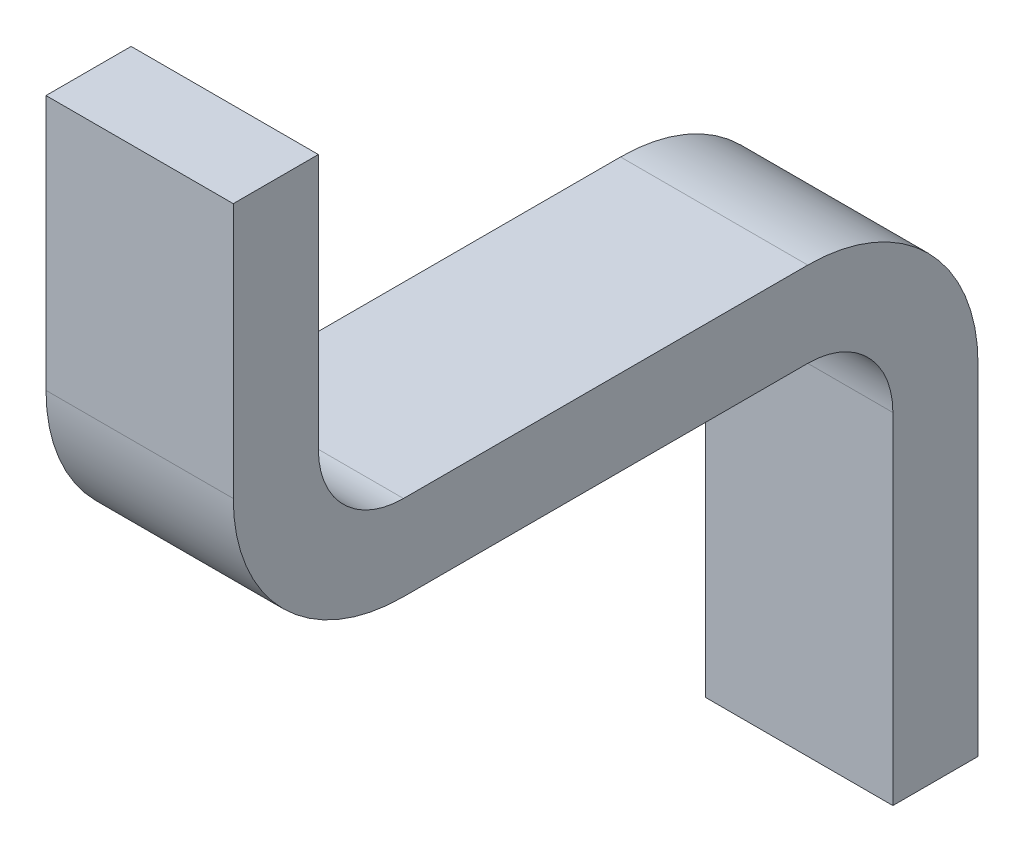
ISO-10303-21;
HEADER;
FILE_DESCRIPTION(('STEP AP214'),'2;1');
FILE_NAME('part.step','',(''),(''),'','','');
FILE_SCHEMA(('AUTOMOTIVE_DESIGN { 1 0 10303 214 1 1 1 1 }'));
ENDSEC;
DATA;
#1=APPLICATION_CONTEXT('core data for automotive mechanical design processes');
#2=APPLICATION_PROTOCOL_DEFINITION('international standard','automotive_design',2000,#1);
#3=PRODUCT_CONTEXT('',#1,'mechanical');
#4=PRODUCT('Part','Part','',(#3));
#5=PRODUCT_RELATED_PRODUCT_CATEGORY('part','',(#4));
#6=PRODUCT_DEFINITION_FORMATION('','',#4);
#7=PRODUCT_DEFINITION_CONTEXT('part definition',#1,'design');
#8=PRODUCT_DEFINITION('design','',#6,#7);
#9=PRODUCT_DEFINITION_SHAPE('','',#8);
#10=(LENGTH_UNIT() NAMED_UNIT(*) SI_UNIT(.MILLI.,.METRE.));
#11=(NAMED_UNIT(*) PLANE_ANGLE_UNIT() SI_UNIT($,.RADIAN.));
#12=(NAMED_UNIT(*) SI_UNIT($,.STERADIAN.) SOLID_ANGLE_UNIT());
#13=UNCERTAINTY_MEASURE_WITH_UNIT(LENGTH_MEASURE(1.E-05),#10,'distance_accuracy_value','');
#14=(GEOMETRIC_REPRESENTATION_CONTEXT(3) GLOBAL_UNCERTAINTY_ASSIGNED_CONTEXT((#13)) GLOBAL_UNIT_ASSIGNED_CONTEXT((#10,
#11,#12)) REPRESENTATION_CONTEXT('',''));
#15=CARTESIAN_POINT('',(0.,0.,0.));
#16=DIRECTION('',(0.,0.,1.));
#17=DIRECTION('',(1.,0.,0.));
#18=AXIS2_PLACEMENT_3D('',#15,#16,#17);
#19=CARTESIAN_POINT('',(0.64,-4.,0.675));
#20=DIRECTION('',(1.,0.,0.));
#21=DIRECTION('',(0.,1.,0.));
#22=AXIS2_PLACEMENT_3D('',#19,#20,#21);
#23=PLANE('',#22);
#24=CARTESIAN_POINT('',(0.640000000000001,-3.8,0.675));
#25=DIRECTION('',(-1.,0.,0.));
#26=DIRECTION('',(0.,-1.,0.));
#27=AXIS2_PLACEMENT_3D('',#24,#25,#26);
#28=CIRCLE('',#27,0.2);
#29=CARTESIAN_POINT('',(0.640000000000001,-3.8,0.875));
#30=VERTEX_POINT('',#29);
#31=CARTESIAN_POINT('',(0.64,-4.,0.675));
#32=VERTEX_POINT('',#31);
#33=EDGE_CURVE('E150',#30,#32,#28,.F.);
#34=ORIENTED_EDGE('',*,*,#33,.F.);
#35=DIRECTION('',(0.,1.,0.));
#36=VECTOR('',#35,1.);
#37=CARTESIAN_POINT('',(0.64,-3.50000000000001,0.875));
#38=LINE('',#37,#36);
#39=CARTESIAN_POINT('',(0.64,-3.50000000000001,0.875));
#40=VERTEX_POINT('',#39);
#41=EDGE_CURVE('E147',#30,#40,#38,.T.);
#42=ORIENTED_EDGE('',*,*,#41,.T.);
#43=DIRECTION('',(0.,0.,1.));
#44=VECTOR('',#43,1.);
#45=CARTESIAN_POINT('',(0.64,-3.50000000000001,0.775));
#46=LINE('',#45,#44);
#47=CARTESIAN_POINT('',(0.64,-3.50000000000001,0.775));
#48=VERTEX_POINT('',#47);
#49=EDGE_CURVE('E141',#48,#40,#46,.T.);
#50=ORIENTED_EDGE('',*,*,#49,.F.);
#51=DIRECTION('',(0.,1.,0.));
#52=VECTOR('',#51,1.);
#53=CARTESIAN_POINT('',(0.64,-3.50000000000001,0.775));
#54=LINE('',#53,#52);
#55=CARTESIAN_POINT('',(0.640000000000001,-3.8,0.775));
#56=VERTEX_POINT('',#55);
#57=EDGE_CURVE('E115',#48,#56,#54,.F.);
#58=ORIENTED_EDGE('',*,*,#57,.T.);
#59=CARTESIAN_POINT('',(0.640000000000001,-3.8,0.675));
#60=DIRECTION('',(-1.,0.,0.));
#61=DIRECTION('',(0.,-1.,0.));
#62=AXIS2_PLACEMENT_3D('',#59,#60,#61);
#63=CIRCLE('',#62,0.1);
#64=CARTESIAN_POINT('',(0.640000000000001,-3.90000000000001,0.675));
#65=VERTEX_POINT('',#64);
#66=EDGE_CURVE('E215',#56,#65,#63,.F.);
#67=ORIENTED_EDGE('',*,*,#66,.T.);
#68=DIRECTION('',(0.,0.,1.));
#69=VECTOR('',#68,1.);
#70=CARTESIAN_POINT('',(0.640000000000001,-3.90000000000001,0.675));
#71=LINE('',#70,#69);
#72=CARTESIAN_POINT('',(0.640000000000001,-3.90000000000001,0.2));
#73=VERTEX_POINT('',#72);
#74=EDGE_CURVE('E181',#65,#73,#71,.F.);
#75=ORIENTED_EDGE('',*,*,#74,.T.);
#76=CARTESIAN_POINT('',(0.64,-4.1,0.2));
#77=DIRECTION('',(1.,0.,0.));
#78=DIRECTION('',(0.,1.,0.));
#79=AXIS2_PLACEMENT_3D('',#76,#77,#78);
#80=CIRCLE('',#79,0.2);
#81=CARTESIAN_POINT('',(0.64,-4.1,0.));
#82=VERTEX_POINT('',#81);
#83=EDGE_CURVE('E20',#82,#73,#80,.T.);
#84=ORIENTED_EDGE('',*,*,#83,.F.);
#85=DIRECTION('',(0.,1.,0.));
#86=VECTOR('',#85,1.);
#87=CARTESIAN_POINT('',(0.64,-4.1,0.));
#88=LINE('',#87,#86);
#89=CARTESIAN_POINT('',(0.64,-4.5,0.));
#90=VERTEX_POINT('',#89);
#91=EDGE_CURVE('E91',#82,#90,#88,.F.);
#92=ORIENTED_EDGE('',*,*,#91,.T.);
#93=DIRECTION('',(0.,0.,1.));
#94=VECTOR('',#93,1.);
#95=CARTESIAN_POINT('',(0.64,-4.5,0.));
#96=LINE('',#95,#94);
#97=CARTESIAN_POINT('',(0.64,-4.5,0.1));
#98=VERTEX_POINT('',#97);
#99=EDGE_CURVE('E163',#90,#98,#96,.T.);
#100=ORIENTED_EDGE('',*,*,#99,.T.);
#101=DIRECTION('',(0.,1.,0.));
#102=VECTOR('',#101,1.);
#103=CARTESIAN_POINT('',(0.64,-4.1,0.1));
#104=LINE('',#103,#102);
#105=CARTESIAN_POINT('',(0.64,-4.1,0.1));
#106=VERTEX_POINT('',#105);
#107=EDGE_CURVE('E159',#98,#106,#104,.T.);
#108=ORIENTED_EDGE('',*,*,#107,.T.);
#109=CARTESIAN_POINT('',(0.64,-4.1,0.2));
#110=DIRECTION('',(1.,0.,0.));
#111=DIRECTION('',(0.,1.,0.));
#112=AXIS2_PLACEMENT_3D('',#109,#110,#111);
#113=CIRCLE('',#112,0.1);
#114=CARTESIAN_POINT('',(0.64,-4.,0.2));
#115=VERTEX_POINT('',#114);
#116=EDGE_CURVE('E155',#106,#115,#113,.T.);
#117=ORIENTED_EDGE('',*,*,#116,.T.);
#118=DIRECTION('',(0.,0.,1.));
#119=VECTOR('',#118,1.);
#120=CARTESIAN_POINT('',(0.64,-4.,0.675));
#121=LINE('',#120,#119);
#122=EDGE_CURVE('E154',#115,#32,#121,.T.);
#123=ORIENTED_EDGE('',*,*,#122,.T.);
#124=EDGE_LOOP('',(#34,#42,#50,#58,#67,#75,#84,#92,#100,#108,#117,#123));
#125=FACE_BOUND('',#124,.T.);
#126=ADVANCED_FACE('F17',(#125),#23,.F.);
#127=CARTESIAN_POINT('',(0.64,-4.1,0.2));
#128=DIRECTION('',(1.,0.,0.));
#129=DIRECTION('',(0.,1.,0.));
#130=AXIS2_PLACEMENT_3D('',#127,#128,#129);
#131=CYLINDRICAL_SURFACE('',#130,0.2);
#132=CARTESIAN_POINT('',(0.86,-4.1,0.2));
#133=DIRECTION('',(1.,0.,0.));
#134=DIRECTION('',(0.,1.,0.));
#135=AXIS2_PLACEMENT_3D('',#132,#133,#134);
#136=CIRCLE('',#135,0.2);
#137=CARTESIAN_POINT('',(0.860000000000001,-3.90000000000001,0.2));
#138=VERTEX_POINT('',#137);
#139=CARTESIAN_POINT('',(0.86,-4.1,0.));
#140=VERTEX_POINT('',#139);
#141=EDGE_CURVE('E183',#138,#140,#136,.F.);
#142=ORIENTED_EDGE('',*,*,#141,.T.);
#143=DIRECTION('',(1.,0.,0.));
#144=VECTOR('',#143,1.);
#145=CARTESIAN_POINT('',(0.64,-4.1,0.));
#146=LINE('',#145,#144);
#147=EDGE_CURVE('E178',#140,#82,#146,.F.);
#148=ORIENTED_EDGE('',*,*,#147,.T.);
#149=ORIENTED_EDGE('',*,*,#83,.T.);
#150=DIRECTION('',(1.,0.,0.));
#151=VECTOR('',#150,1.);
#152=CARTESIAN_POINT('',(0.640000000000001,-3.90000000000001,0.2));
#153=LINE('',#152,#151);
#154=EDGE_CURVE('E217',#73,#138,#153,.T.);
#155=ORIENTED_EDGE('',*,*,#154,.T.);
#156=EDGE_LOOP('',(#142,#148,#149,#155));
#157=FACE_BOUND('',#156,.T.);
#158=ADVANCED_FACE('F254',(#157),#131,.T.);
#159=CARTESIAN_POINT('',(0.64,-4.1,0.));
#160=DIRECTION('',(0.,0.,1.));
#161=DIRECTION('',(1.,0.,0.));
#162=AXIS2_PLACEMENT_3D('',#159,#160,#161);
#163=PLANE('',#162);
#164=ORIENTED_EDGE('',*,*,#147,.F.);
#165=DIRECTION('',(0.,-1.,0.));
#166=VECTOR('',#165,1.);
#167=CARTESIAN_POINT('',(0.860000000000001,-3.90000000000001,0.));
#168=LINE('',#167,#166);
#169=CARTESIAN_POINT('',(0.86,-4.5,0.));
#170=VERTEX_POINT('',#169);
#171=EDGE_CURVE('E170',#140,#170,#168,.T.);
#172=ORIENTED_EDGE('',*,*,#171,.T.);
#173=DIRECTION('',(-1.,0.,0.));
#174=VECTOR('',#173,1.);
#175=CARTESIAN_POINT('',(0.64,-4.5,0.));
#176=LINE('',#175,#174);
#177=EDGE_CURVE('E173',#170,#90,#176,.T.);
#178=ORIENTED_EDGE('',*,*,#177,.T.);
#179=ORIENTED_EDGE('',*,*,#91,.F.);
#180=EDGE_LOOP('',(#164,#172,#178,#179));
#181=FACE_BOUND('',#180,.T.);
#182=ADVANCED_FACE('F257',(#181),#163,.F.);
#183=CARTESIAN_POINT('',(0.64,-4.5,0.));
#184=DIRECTION('',(0.,1.,0.));
#185=DIRECTION('',(-1.,0.,0.));
#186=AXIS2_PLACEMENT_3D('',#183,#184,#185);
#187=PLANE('',#186);
#188=DIRECTION('',(-1.,0.,0.));
#189=VECTOR('',#188,1.);
#190=CARTESIAN_POINT('',(0.86,-4.5,0.1));
#191=LINE('',#190,#189);
#192=CARTESIAN_POINT('',(0.86,-4.5,0.1));
#193=VERTEX_POINT('',#192);
#194=EDGE_CURVE('E160',#193,#98,#191,.T.);
#195=ORIENTED_EDGE('',*,*,#194,.T.);
#196=ORIENTED_EDGE('',*,*,#99,.F.);
#197=ORIENTED_EDGE('',*,*,#177,.F.);
#198=DIRECTION('',(0.,0.,1.));
#199=VECTOR('',#198,1.);
#200=CARTESIAN_POINT('',(0.86,-4.5,0.675));
#201=LINE('',#200,#199);
#202=EDGE_CURVE('E166',#170,#193,#201,.T.);
#203=ORIENTED_EDGE('',*,*,#202,.T.);
#204=EDGE_LOOP('',(#195,#196,#197,#203));
#205=FACE_BOUND('',#204,.T.);
#206=ADVANCED_FACE('F259',(#205),#187,.F.);
#207=CARTESIAN_POINT('',(0.86,-4.1,0.1));
#208=DIRECTION('',(0.,0.,-1.));
#209=DIRECTION('',(-1.,0.,0.));
#210=AXIS2_PLACEMENT_3D('',#207,#208,#209);
#211=PLANE('',#210);
#212=DIRECTION('',(1.,0.,0.));
#213=VECTOR('',#212,1.);
#214=CARTESIAN_POINT('',(0.86,-4.1,0.1));
#215=LINE('',#214,#213);
#216=CARTESIAN_POINT('',(0.86,-4.1,0.1));
#217=VERTEX_POINT('',#216);
#218=EDGE_CURVE('E156',#217,#106,#215,.F.);
#219=ORIENTED_EDGE('',*,*,#218,.T.);
#220=ORIENTED_EDGE('',*,*,#107,.F.);
#221=ORIENTED_EDGE('',*,*,#194,.F.);
#222=DIRECTION('',(0.,-1.,0.));
#223=VECTOR('',#222,1.);
#224=CARTESIAN_POINT('',(0.860000000000001,-3.90000000000001,0.1));
#225=LINE('',#224,#223);
#226=EDGE_CURVE('E169',#193,#217,#225,.F.);
#227=ORIENTED_EDGE('',*,*,#226,.T.);
#228=EDGE_LOOP('',(#219,#220,#221,#227));
#229=FACE_BOUND('',#228,.T.);
#230=ADVANCED_FACE('F234',(#229),#211,.F.);
#231=CARTESIAN_POINT('',(0.86,-4.1,0.2));
#232=DIRECTION('',(1.,0.,0.));
#233=DIRECTION('',(0.,1.,0.));
#234=AXIS2_PLACEMENT_3D('',#231,#232,#233);
#235=CYLINDRICAL_SURFACE('',#234,0.1);
#236=DIRECTION('',(-1.,0.,0.));
#237=VECTOR('',#236,1.);
#238=CARTESIAN_POINT('',(0.86,-4.,0.2));
#239=LINE('',#238,#237);
#240=CARTESIAN_POINT('',(0.86,-4.,0.2));
#241=VERTEX_POINT('',#240);
#242=EDGE_CURVE('E151',#241,#115,#239,.T.);
#243=ORIENTED_EDGE('',*,*,#242,.T.);
#244=ORIENTED_EDGE('',*,*,#116,.F.);
#245=ORIENTED_EDGE('',*,*,#218,.F.);
#246=CARTESIAN_POINT('',(0.86,-4.1,0.2));
#247=DIRECTION('',(1.,0.,0.));
#248=DIRECTION('',(0.,1.,0.));
#249=AXIS2_PLACEMENT_3D('',#246,#247,#248);
#250=CIRCLE('',#249,0.1);
#251=EDGE_CURVE('E210',#217,#241,#250,.T.);
#252=ORIENTED_EDGE('',*,*,#251,.T.);
#253=EDGE_LOOP('',(#243,#244,#245,#252));
#254=FACE_BOUND('',#253,.T.);
#255=ADVANCED_FACE('F227',(#254),#235,.F.);
#256=CARTESIAN_POINT('',(0.86,-4.,0.675));
#257=DIRECTION('',(0.,1.,0.));
#258=DIRECTION('',(-1.,0.,0.));
#259=AXIS2_PLACEMENT_3D('',#256,#257,#258);
#260=PLANE('',#259);
#261=DIRECTION('',(-1.,0.,0.));
#262=VECTOR('',#261,1.);
#263=CARTESIAN_POINT('',(0.86,-4.,0.675));
#264=LINE('',#263,#262);
#265=CARTESIAN_POINT('',(0.86,-4.,0.675));
#266=VERTEX_POINT('',#265);
#267=EDGE_CURVE('E148',#32,#266,#264,.F.);
#268=ORIENTED_EDGE('',*,*,#267,.F.);
#269=ORIENTED_EDGE('',*,*,#122,.F.);
#270=ORIENTED_EDGE('',*,*,#242,.F.);
#271=DIRECTION('',(0.,0.,1.));
#272=VECTOR('',#271,1.);
#273=CARTESIAN_POINT('',(0.86,-4.,0.675));
#274=LINE('',#273,#272);
#275=EDGE_CURVE('E209',#241,#266,#274,.T.);
#276=ORIENTED_EDGE('',*,*,#275,.T.);
#277=EDGE_LOOP('',(#268,#269,#270,#276));
#278=FACE_BOUND('',#277,.T.);
#279=ADVANCED_FACE('F224',(#278),#260,.F.);
#280=CARTESIAN_POINT('',(0.860000000000001,-3.8,0.675));
#281=DIRECTION('',(-1.,0.,0.));
#282=DIRECTION('',(0.,-1.,0.));
#283=AXIS2_PLACEMENT_3D('',#280,#281,#282);
#284=CYLINDRICAL_SURFACE('',#283,0.2);
#285=ORIENTED_EDGE('',*,*,#33,.T.);
#286=ORIENTED_EDGE('',*,*,#267,.T.);
#287=CARTESIAN_POINT('',(0.860000000000001,-3.8,0.675));
#288=DIRECTION('',(-1.,0.,0.));
#289=DIRECTION('',(0.,-1.,0.));
#290=AXIS2_PLACEMENT_3D('',#287,#288,#289);
#291=CIRCLE('',#290,0.2);
#292=CARTESIAN_POINT('',(0.860000000000001,-3.8,0.875));
#293=VERTEX_POINT('',#292);
#294=EDGE_CURVE('E133',#266,#293,#291,.T.);
#295=ORIENTED_EDGE('',*,*,#294,.T.);
#296=DIRECTION('',(-1.,0.,0.));
#297=VECTOR('',#296,1.);
#298=CARTESIAN_POINT('',(0.860000000000001,-3.8,0.875));
#299=LINE('',#298,#297);
#300=EDGE_CURVE('E144',#293,#30,#299,.T.);
#301=ORIENTED_EDGE('',*,*,#300,.T.);
#302=EDGE_LOOP('',(#285,#286,#295,#301));
#303=FACE_BOUND('',#302,.T.);
#304=ADVANCED_FACE('F285',(#303),#284,.T.);
#305=CARTESIAN_POINT('',(0.86,-3.50000000000001,0.875));
#306=DIRECTION('',(0.,0.,-1.));
#307=DIRECTION('',(-1.,0.,0.));
#308=AXIS2_PLACEMENT_3D('',#305,#306,#307);
#309=PLANE('',#308);
#310=DIRECTION('',(-1.,0.,0.));
#311=VECTOR('',#310,1.);
#312=CARTESIAN_POINT('',(0.64,-3.50000000000001,0.875));
#313=LINE('',#312,#311);
#314=CARTESIAN_POINT('',(0.86,-3.50000000000001,0.875));
#315=VERTEX_POINT('',#314);
#316=EDGE_CURVE('E118',#40,#315,#313,.F.);
#317=ORIENTED_EDGE('',*,*,#316,.F.);
#318=ORIENTED_EDGE('',*,*,#41,.F.);
#319=ORIENTED_EDGE('',*,*,#300,.F.);
#320=DIRECTION('',(0.,-1.,0.));
#321=VECTOR('',#320,1.);
#322=CARTESIAN_POINT('',(0.860000000000001,-3.90000000000001,0.875));
#323=LINE('',#322,#321);
#324=EDGE_CURVE('E131',#293,#315,#323,.F.);
#325=ORIENTED_EDGE('',*,*,#324,.T.);
#326=EDGE_LOOP('',(#317,#318,#319,#325));
#327=FACE_BOUND('',#326,.T.);
#328=ADVANCED_FACE('F282',(#327),#309,.F.);
#329=CARTESIAN_POINT('',(0.64,-3.50000000000001,0.775));
#330=DIRECTION('',(0.,1.,0.));
#331=DIRECTION('',(-1.,0.,0.));
#332=AXIS2_PLACEMENT_3D('',#329,#330,#331);
#333=PLANE('',#332);
#334=ORIENTED_EDGE('',*,*,#49,.T.);
#335=ORIENTED_EDGE('',*,*,#316,.T.);
#336=DIRECTION('',(0.,0.,1.));
#337=VECTOR('',#336,1.);
#338=CARTESIAN_POINT('',(0.86,-3.50000000000001,0.675));
#339=LINE('',#338,#337);
#340=CARTESIAN_POINT('',(0.86,-3.50000000000001,0.775));
#341=VERTEX_POINT('',#340);
#342=EDGE_CURVE('E125',#315,#341,#339,.F.);
#343=ORIENTED_EDGE('',*,*,#342,.T.);
#344=DIRECTION('',(1.,0.,0.));
#345=VECTOR('',#344,1.);
#346=CARTESIAN_POINT('',(0.64,-3.50000000000001,0.775));
#347=LINE('',#346,#345);
#348=EDGE_CURVE('E110',#341,#48,#347,.F.);
#349=ORIENTED_EDGE('',*,*,#348,.T.);
#350=EDGE_LOOP('',(#334,#335,#343,#349));
#351=FACE_BOUND('',#350,.T.);
#352=ADVANCED_FACE('F129',(#351),#333,.T.);
#353=CARTESIAN_POINT('',(0.64,-3.50000000000001,0.775));
#354=DIRECTION('',(0.,0.,1.));
#355=DIRECTION('',(1.,0.,0.));
#356=AXIS2_PLACEMENT_3D('',#353,#354,#355);
#357=PLANE('',#356);
#358=ORIENTED_EDGE('',*,*,#348,.F.);
#359=DIRECTION('',(0.,-1.,0.));
#360=VECTOR('',#359,1.);
#361=CARTESIAN_POINT('',(0.860000000000001,-3.90000000000001,0.775));
#362=LINE('',#361,#360);
#363=CARTESIAN_POINT('',(0.860000000000001,-3.8,0.775));
#364=VERTEX_POINT('',#363);
#365=EDGE_CURVE('E114',#341,#364,#362,.T.);
#366=ORIENTED_EDGE('',*,*,#365,.T.);
#367=DIRECTION('',(-1.,0.,0.));
#368=VECTOR('',#367,1.);
#369=CARTESIAN_POINT('',(0.640000000000001,-3.8,0.775));
#370=LINE('',#369,#368);
#371=EDGE_CURVE('E185',#364,#56,#370,.T.);
#372=ORIENTED_EDGE('',*,*,#371,.T.);
#373=ORIENTED_EDGE('',*,*,#57,.F.);
#374=EDGE_LOOP('',(#358,#366,#372,#373));
#375=FACE_BOUND('',#374,.T.);
#376=ADVANCED_FACE('F112',(#375),#357,.F.);
#377=CARTESIAN_POINT('',(0.640000000000001,-3.8,0.675));
#378=DIRECTION('',(-1.,0.,0.));
#379=DIRECTION('',(0.,-1.,0.));
#380=AXIS2_PLACEMENT_3D('',#377,#378,#379);
#381=CYLINDRICAL_SURFACE('',#380,0.1);
#382=ORIENTED_EDGE('',*,*,#371,.F.);
#383=CARTESIAN_POINT('',(0.860000000000001,-3.8,0.675));
#384=DIRECTION('',(-1.,0.,0.));
#385=DIRECTION('',(0.,-1.,0.));
#386=AXIS2_PLACEMENT_3D('',#383,#384,#385);
#387=CIRCLE('',#386,0.1);
#388=CARTESIAN_POINT('',(0.860000000000001,-3.90000000000001,0.675));
#389=VERTEX_POINT('',#388);
#390=EDGE_CURVE('E26',#364,#389,#387,.F.);
#391=ORIENTED_EDGE('',*,*,#390,.T.);
#392=DIRECTION('',(1.,0.,0.));
#393=VECTOR('',#392,1.);
#394=CARTESIAN_POINT('',(0.640000000000001,-3.90000000000001,0.675));
#395=LINE('',#394,#393);
#396=EDGE_CURVE('E34',#389,#65,#395,.F.);
#397=ORIENTED_EDGE('',*,*,#396,.T.);
#398=ORIENTED_EDGE('',*,*,#66,.F.);
#399=EDGE_LOOP('',(#382,#391,#397,#398));
#400=FACE_BOUND('',#399,.T.);
#401=ADVANCED_FACE('F250',(#400),#381,.F.);
#402=CARTESIAN_POINT('',(0.640000000000001,-3.90000000000001,0.675));
#403=DIRECTION('',(0.,-1.,0.));
#404=DIRECTION('',(1.,0.,0.));
#405=AXIS2_PLACEMENT_3D('',#402,#403,#404);
#406=PLANE('',#405);
#407=ORIENTED_EDGE('',*,*,#396,.F.);
#408=DIRECTION('',(0.,0.,1.));
#409=VECTOR('',#408,1.);
#410=CARTESIAN_POINT('',(0.860000000000001,-3.90000000000001,0.675));
#411=LINE('',#410,#409);
#412=EDGE_CURVE('E11',#389,#138,#411,.F.);
#413=ORIENTED_EDGE('',*,*,#412,.T.);
#414=ORIENTED_EDGE('',*,*,#154,.F.);
#415=ORIENTED_EDGE('',*,*,#74,.F.);
#416=EDGE_LOOP('',(#407,#413,#414,#415));
#417=FACE_BOUND('',#416,.T.);
#418=ADVANCED_FACE('F252',(#417),#406,.F.);
#419=CARTESIAN_POINT('',(0.860000000000001,-3.90000000000001,0.675));
#420=DIRECTION('',(-1.,0.,0.));
#421=DIRECTION('',(0.,-1.,0.));
#422=AXIS2_PLACEMENT_3D('',#419,#420,#421);
#423=PLANE('',#422);
#424=ORIENTED_EDGE('',*,*,#390,.F.);
#425=ORIENTED_EDGE('',*,*,#365,.F.);
#426=ORIENTED_EDGE('',*,*,#342,.F.);
#427=ORIENTED_EDGE('',*,*,#324,.F.);
#428=ORIENTED_EDGE('',*,*,#294,.F.);
#429=ORIENTED_EDGE('',*,*,#275,.F.);
#430=ORIENTED_EDGE('',*,*,#251,.F.);
#431=ORIENTED_EDGE('',*,*,#226,.F.);
#432=ORIENTED_EDGE('',*,*,#202,.F.);
#433=ORIENTED_EDGE('',*,*,#171,.F.);
#434=ORIENTED_EDGE('',*,*,#141,.F.);
#435=ORIENTED_EDGE('',*,*,#412,.F.);
#436=EDGE_LOOP('',(#424,#425,#426,#427,#428,#429,#430,#431,#432,#433,#434,#435));
#437=FACE_BOUND('',#436,.T.);
#438=ADVANCED_FACE('F123',(#437),#423,.F.);
#439=CLOSED_SHELL('',(#126,#158,#182,#206,#230,#255,#279,#304,#328,#352,#376,#401,#418,#438));
#440=MANIFOLD_SOLID_BREP('B1',#439);
#441=ADVANCED_BREP_SHAPE_REPRESENTATION('',(#18,#440),#14);
#442=SHAPE_DEFINITION_REPRESENTATION(#9,#441);
ENDSEC;
END-ISO-10303-21;
